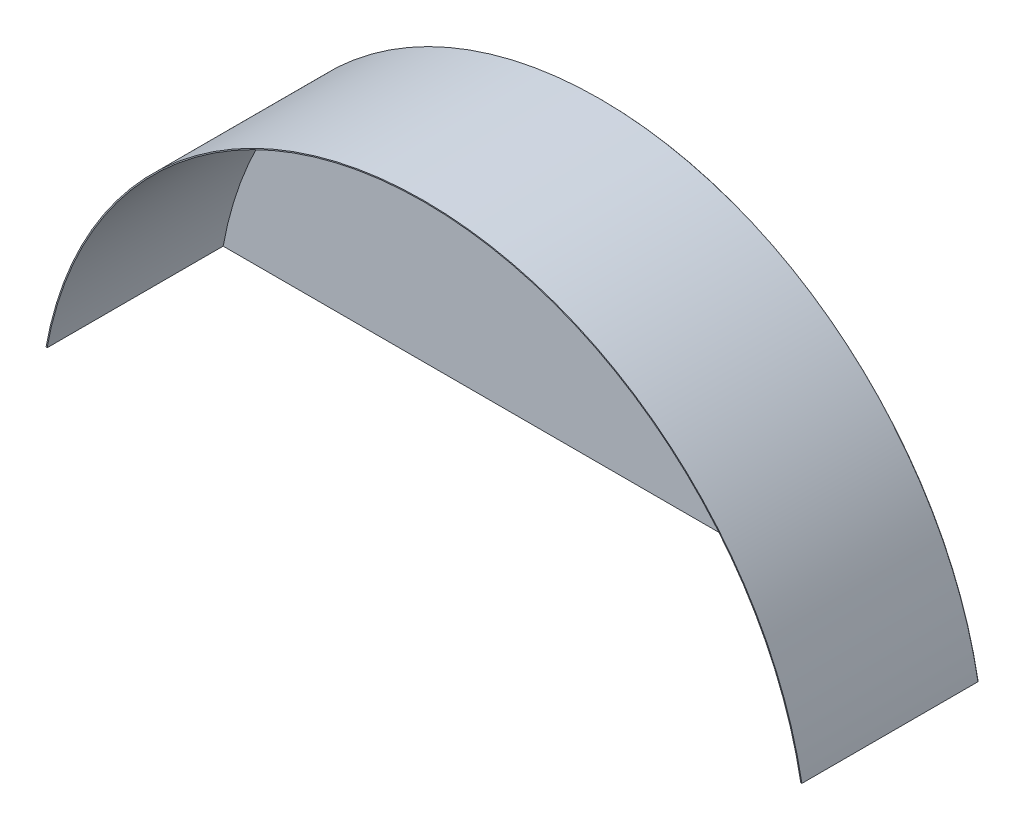
ISO-10303-21;
HEADER;
FILE_DESCRIPTION(('STEP AP214'),'2;1');
FILE_NAME('part.step','',(''),(''),'','','');
FILE_SCHEMA(('AUTOMOTIVE_DESIGN { 1 0 10303 214 1 1 1 1 }'));
ENDSEC;
DATA;
#1=APPLICATION_CONTEXT('core data for automotive mechanical design processes');
#2=APPLICATION_PROTOCOL_DEFINITION('international standard','automotive_design',2000,#1);
#3=PRODUCT_CONTEXT('',#1,'mechanical');
#4=PRODUCT('Part','Part','',(#3));
#5=PRODUCT_RELATED_PRODUCT_CATEGORY('part','',(#4));
#6=PRODUCT_DEFINITION_FORMATION('','',#4);
#7=PRODUCT_DEFINITION_CONTEXT('part definition',#1,'design');
#8=PRODUCT_DEFINITION('design','',#6,#7);
#9=PRODUCT_DEFINITION_SHAPE('','',#8);
#10=(LENGTH_UNIT() NAMED_UNIT(*) SI_UNIT(.MILLI.,.METRE.));
#11=(NAMED_UNIT(*) PLANE_ANGLE_UNIT() SI_UNIT($,.RADIAN.));
#12=(NAMED_UNIT(*) SI_UNIT($,.STERADIAN.) SOLID_ANGLE_UNIT());
#13=UNCERTAINTY_MEASURE_WITH_UNIT(LENGTH_MEASURE(1.E-05),#10,'distance_accuracy_value','');
#14=(GEOMETRIC_REPRESENTATION_CONTEXT(3) GLOBAL_UNCERTAINTY_ASSIGNED_CONTEXT((#13)) GLOBAL_UNIT_ASSIGNED_CONTEXT((#10,
#11,#12)) REPRESENTATION_CONTEXT('',''));
#15=CARTESIAN_POINT('',(0.,0.,0.));
#16=DIRECTION('',(0.,0.,1.));
#17=DIRECTION('',(1.,0.,0.));
#18=AXIS2_PLACEMENT_3D('',#15,#16,#17);
#19=CARTESIAN_POINT('',(0.,-96.662192393736,250.));
#20=DIRECTION('',(0.,0.,-1.));
#21=DIRECTION('',(-1.,0.,0.));
#22=AXIS2_PLACEMENT_3D('',#19,#20,#21);
#23=CYLINDRICAL_SURFACE('',#22,545.162192393736);
#24=CARTESIAN_POINT('',(0.,-96.662192393736,0.));
#25=DIRECTION('',(0.,0.,1.));
#26=DIRECTION('',(1.,0.,0.));
#27=AXIS2_PLACEMENT_3D('',#24,#25,#26);
#28=CIRCLE('',#27,545.162192393736);
#29=CARTESIAN_POINT('',(536.476100437418,0.266697391540477,0.));
#30=VERTEX_POINT('',#29);
#31=CARTESIAN_POINT('',(-536.476100437418,0.266697391540421,0.));
#32=VERTEX_POINT('',#31);
#33=EDGE_CURVE('E121',#30,#32,#28,.T.);
#34=ORIENTED_EDGE('',*,*,#33,.T.);
#35=DIRECTION('',(0.,0.,-1.));
#36=VECTOR('',#35,1.);
#37=CARTESIAN_POINT('',(-536.476100437418,0.266697391540421,250.));
#38=LINE('',#37,#36);
#39=CARTESIAN_POINT('',(-536.476100437418,0.266697391540421,250.));
#40=VERTEX_POINT('',#39);
#41=EDGE_CURVE('E12',#40,#32,#38,.T.);
#42=ORIENTED_EDGE('',*,*,#41,.F.);
#43=CARTESIAN_POINT('',(0.,-96.662192393736,250.));
#44=DIRECTION('',(0.,0.,1.));
#45=DIRECTION('',(1.,0.,0.));
#46=AXIS2_PLACEMENT_3D('',#43,#44,#45);
#47=CIRCLE('',#46,545.162192393736);
#48=CARTESIAN_POINT('',(536.476100437418,0.266697391540477,250.));
#49=VERTEX_POINT('',#48);
#50=EDGE_CURVE('E94',#49,#40,#47,.T.);
#51=ORIENTED_EDGE('',*,*,#50,.F.);
#52=DIRECTION('',(0.,0.,-1.));
#53=VECTOR('',#52,1.);
#54=CARTESIAN_POINT('',(536.476100437418,0.266697391540477,250.));
#55=LINE('',#54,#53);
#56=EDGE_CURVE('E70',#49,#30,#55,.T.);
#57=ORIENTED_EDGE('',*,*,#56,.T.);
#58=EDGE_LOOP('',(#34,#42,#51,#57));
#59=FACE_BOUND('',#58,.T.);
#60=ADVANCED_FACE('F53',(#59),#23,.T.);
#61=CARTESIAN_POINT('',(-535.,0.,250.));
#62=DIRECTION('',(-0.177798261027015,-0.984066958278637,0.));
#63=DIRECTION('',(0.984066958278637,-0.177798261027015,0.));
#64=AXIS2_PLACEMENT_3D('',#61,#62,#63);
#65=PLANE('',#64);
#66=DIRECTION('',(-0.984066958278637,0.177798261027015,0.));
#67=VECTOR('',#66,1.);
#68=CARTESIAN_POINT('',(-535.,0.,0.));
#69=LINE('',#68,#67);
#70=CARTESIAN_POINT('',(-535.,0.,0.));
#71=VERTEX_POINT('',#70);
#72=EDGE_CURVE('E103',#71,#32,#69,.T.);
#73=ORIENTED_EDGE('',*,*,#72,.F.);
#74=DIRECTION('',(0.,0.,-1.));
#75=VECTOR('',#74,1.);
#76=CARTESIAN_POINT('',(-535.,0.,250.));
#77=LINE('',#76,#75);
#78=CARTESIAN_POINT('',(-535.,0.,250.));
#79=VERTEX_POINT('',#78);
#80=EDGE_CURVE('E62',#79,#71,#77,.T.);
#81=ORIENTED_EDGE('',*,*,#80,.F.);
#82=DIRECTION('',(-0.984066958278637,0.177798261027015,0.));
#83=VECTOR('',#82,1.);
#84=CARTESIAN_POINT('',(-535.,0.,250.));
#85=LINE('',#84,#83);
#86=EDGE_CURVE('E101',#79,#40,#85,.T.);
#87=ORIENTED_EDGE('',*,*,#86,.T.);
#88=ORIENTED_EDGE('',*,*,#41,.T.);
#89=EDGE_LOOP('',(#73,#81,#87,#88));
#90=FACE_BOUND('',#89,.T.);
#91=ADVANCED_FACE('F100',(#90),#65,.T.);
#92=CARTESIAN_POINT('',(0.,-96.662192393736,250.));
#93=DIRECTION('',(0.,0.,-1.));
#94=DIRECTION('',(-1.,0.,0.));
#95=AXIS2_PLACEMENT_3D('',#92,#93,#94);
#96=CYLINDRICAL_SURFACE('',#95,543.662192393736);
#97=CARTESIAN_POINT('',(0.,-96.662192393736,0.));
#98=DIRECTION('',(0.,0.,1.));
#99=DIRECTION('',(1.,0.,0.));
#100=AXIS2_PLACEMENT_3D('',#97,#98,#99);
#101=CIRCLE('',#100,543.662192393736);
#102=CARTESIAN_POINT('',(535.,0.,0.));
#103=VERTEX_POINT('',#102);
#104=EDGE_CURVE('E126',#103,#71,#101,.T.);
#105=ORIENTED_EDGE('',*,*,#104,.F.);
#106=DIRECTION('',(0.,0.,-1.));
#107=VECTOR('',#106,1.);
#108=CARTESIAN_POINT('',(535.,0.,250.));
#109=LINE('',#108,#107);
#110=CARTESIAN_POINT('',(535.,0.,250.));
#111=VERTEX_POINT('',#110);
#112=EDGE_CURVE('E83',#111,#103,#109,.T.);
#113=ORIENTED_EDGE('',*,*,#112,.F.);
#114=CARTESIAN_POINT('',(0.,-96.662192393736,250.));
#115=DIRECTION('',(0.,0.,1.));
#116=DIRECTION('',(1.,0.,0.));
#117=AXIS2_PLACEMENT_3D('',#114,#115,#116);
#118=CIRCLE('',#117,543.662192393736);
#119=EDGE_CURVE('E110',#111,#79,#118,.T.);
#120=ORIENTED_EDGE('',*,*,#119,.T.);
#121=ORIENTED_EDGE('',*,*,#80,.T.);
#122=EDGE_LOOP('',(#105,#113,#120,#121));
#123=FACE_BOUND('',#122,.T.);
#124=ADVANCED_FACE('F113',(#123),#96,.F.);
#125=CARTESIAN_POINT('',(536.476100437418,0.266697391540477,250.));
#126=DIRECTION('',(0.177798261027006,-0.984066958278639,0.));
#127=DIRECTION('',(0.984066958278639,0.177798261027006,0.));
#128=AXIS2_PLACEMENT_3D('',#125,#126,#127);
#129=PLANE('',#128);
#130=DIRECTION('',(-0.984066958278639,-0.177798261027006,0.));
#131=VECTOR('',#130,1.);
#132=CARTESIAN_POINT('',(536.476100437418,0.266697391540477,0.));
#133=LINE('',#132,#131);
#134=EDGE_CURVE('E129',#30,#103,#133,.T.);
#135=ORIENTED_EDGE('',*,*,#134,.F.);
#136=ORIENTED_EDGE('',*,*,#56,.F.);
#137=DIRECTION('',(-0.984066958278639,-0.177798261027006,0.));
#138=VECTOR('',#137,1.);
#139=CARTESIAN_POINT('',(536.476100437418,0.266697391540477,250.));
#140=LINE('',#139,#138);
#141=EDGE_CURVE('E115',#49,#111,#140,.T.);
#142=ORIENTED_EDGE('',*,*,#141,.T.);
#143=ORIENTED_EDGE('',*,*,#112,.T.);
#144=EDGE_LOOP('',(#135,#136,#142,#143));
#145=FACE_BOUND('',#144,.T.);
#146=ADVANCED_FACE('F139',(#145),#129,.T.);
#147=CARTESIAN_POINT('',(0.,-96.662192393736,250.));
#148=DIRECTION('',(0.,0.,1.));
#149=DIRECTION('',(1.,0.,0.));
#150=AXIS2_PLACEMENT_3D('',#147,#148,#149);
#151=PLANE('',#150);
#152=ORIENTED_EDGE('',*,*,#50,.T.);
#153=ORIENTED_EDGE('',*,*,#86,.F.);
#154=ORIENTED_EDGE('',*,*,#119,.F.);
#155=ORIENTED_EDGE('',*,*,#141,.F.);
#156=EDGE_LOOP('',(#152,#153,#154,#155));
#157=FACE_BOUND('',#156,.T.);
#158=ADVANCED_FACE('F109',(#157),#151,.T.);
#159=CARTESIAN_POINT('',(0.,-96.662192393736,0.));
#160=DIRECTION('',(0.,0.,1.));
#161=DIRECTION('',(1.,0.,0.));
#162=AXIS2_PLACEMENT_3D('',#159,#160,#161);
#163=PLANE('',#162);
#164=ORIENTED_EDGE('',*,*,#33,.F.);
#165=ORIENTED_EDGE('',*,*,#134,.T.);
#166=ORIENTED_EDGE('',*,*,#104,.T.);
#167=ORIENTED_EDGE('',*,*,#72,.T.);
#168=EDGE_LOOP('',(#164,#165,#166,#167));
#169=FACE_BOUND('',#168,.T.);
#170=ADVANCED_FACE('F138',(#169),#163,.F.);
#171=CLOSED_SHELL('',(#60,#91,#124,#146,#158,#170));
#172=MANIFOLD_SOLID_BREP('B2',#171);
#173=CARTESIAN_POINT('',(0.,-96.662192393736,-1.5));
#174=DIRECTION('',(0.,0.,1.));
#175=DIRECTION('',(1.,0.,0.));
#176=AXIS2_PLACEMENT_3D('',#173,#174,#175);
#177=CYLINDRICAL_SURFACE('',#176,543.662192393736);
#178=CARTESIAN_POINT('',(0.,-96.662192393736,0.));
#179=DIRECTION('',(0.,0.,1.));
#180=DIRECTION('',(-1.,0.,0.));
#181=AXIS2_PLACEMENT_3D('',#178,#179,#180);
#182=CIRCLE('',#181,543.662192393736);
#183=CARTESIAN_POINT('',(535.,0.,0.));
#184=VERTEX_POINT('',#183);
#185=CARTESIAN_POINT('',(-535.,0.,0.));
#186=VERTEX_POINT('',#185);
#187=EDGE_CURVE('E230',#184,#186,#182,.T.);
#188=ORIENTED_EDGE('',*,*,#187,.F.);
#189=DIRECTION('',(0.,0.,1.));
#190=VECTOR('',#189,1.);
#191=CARTESIAN_POINT('',(535.,0.,-1.5));
#192=LINE('',#191,#190);
#193=CARTESIAN_POINT('',(535.,0.,-1.5));
#194=VERTEX_POINT('',#193);
#195=EDGE_CURVE('E51',#194,#184,#192,.T.);
#196=ORIENTED_EDGE('',*,*,#195,.F.);
#197=CARTESIAN_POINT('',(0.,-96.662192393736,-1.5));
#198=DIRECTION('',(0.,0.,1.));
#199=DIRECTION('',(-1.,0.,0.));
#200=AXIS2_PLACEMENT_3D('',#197,#198,#199);
#201=CIRCLE('',#200,543.662192393736);
#202=CARTESIAN_POINT('',(-535.,0.,-1.5));
#203=VERTEX_POINT('',#202);
#204=EDGE_CURVE('E234',#194,#203,#201,.T.);
#205=ORIENTED_EDGE('',*,*,#204,.T.);
#206=DIRECTION('',(0.,0.,1.));
#207=VECTOR('',#206,1.);
#208=CARTESIAN_POINT('',(-535.,0.,-1.5));
#209=LINE('',#208,#207);
#210=EDGE_CURVE('E204',#203,#186,#209,.T.);
#211=ORIENTED_EDGE('',*,*,#210,.T.);
#212=EDGE_LOOP('',(#188,#196,#205,#211));
#213=FACE_BOUND('',#212,.T.);
#214=ADVANCED_FACE('F201',(#213),#177,.T.);
#215=CARTESIAN_POINT('',(-535.,0.,-1.5));
#216=DIRECTION('',(0.,-1.,0.));
#217=DIRECTION('',(0.,0.,-1.));
#218=AXIS2_PLACEMENT_3D('',#215,#216,#217);
#219=PLANE('',#218);
#220=DIRECTION('',(1.,0.,0.));
#221=VECTOR('',#220,1.);
#222=CARTESIAN_POINT('',(-535.,0.,0.));
#223=LINE('',#222,#221);
#224=EDGE_CURVE('E227',#186,#184,#223,.T.);
#225=ORIENTED_EDGE('',*,*,#224,.F.);
#226=ORIENTED_EDGE('',*,*,#210,.F.);
#227=DIRECTION('',(1.,0.,0.));
#228=VECTOR('',#227,1.);
#229=CARTESIAN_POINT('',(-535.,0.,-1.5));
#230=LINE('',#229,#228);
#231=EDGE_CURVE('E229',#203,#194,#230,.T.);
#232=ORIENTED_EDGE('',*,*,#231,.T.);
#233=ORIENTED_EDGE('',*,*,#195,.T.);
#234=EDGE_LOOP('',(#225,#226,#232,#233));
#235=FACE_BOUND('',#234,.T.);
#236=ADVANCED_FACE('F225',(#235),#219,.T.);
#237=CARTESIAN_POINT('',(0.,-96.662192393736,-1.5));
#238=DIRECTION('',(0.,0.,-1.));
#239=DIRECTION('',(-1.,0.,0.));
#240=AXIS2_PLACEMENT_3D('',#237,#238,#239);
#241=PLANE('',#240);
#242=ORIENTED_EDGE('',*,*,#204,.F.);
#243=ORIENTED_EDGE('',*,*,#231,.F.);
#244=EDGE_LOOP('',(#242,#243));
#245=FACE_BOUND('',#244,.T.);
#246=ADVANCED_FACE('F239',(#245),#241,.T.);
#247=CARTESIAN_POINT('',(0.,-96.662192393736,0.));
#248=DIRECTION('',(0.,0.,-1.));
#249=DIRECTION('',(-1.,0.,0.));
#250=AXIS2_PLACEMENT_3D('',#247,#248,#249);
#251=PLANE('',#250);
#252=ORIENTED_EDGE('',*,*,#187,.T.);
#253=ORIENTED_EDGE('',*,*,#224,.T.);
#254=EDGE_LOOP('',(#252,#253));
#255=FACE_BOUND('',#254,.T.);
#256=ADVANCED_FACE('F233',(#255),#251,.F.);
#257=CLOSED_SHELL('',(#214,#236,#246,#256));
#258=MANIFOLD_SOLID_BREP('B6',#257);
#259=ADVANCED_BREP_SHAPE_REPRESENTATION('',(#18,#172,#258),#14);
#260=SHAPE_DEFINITION_REPRESENTATION(#9,#259);
ENDSEC;
END-ISO-10303-21;
